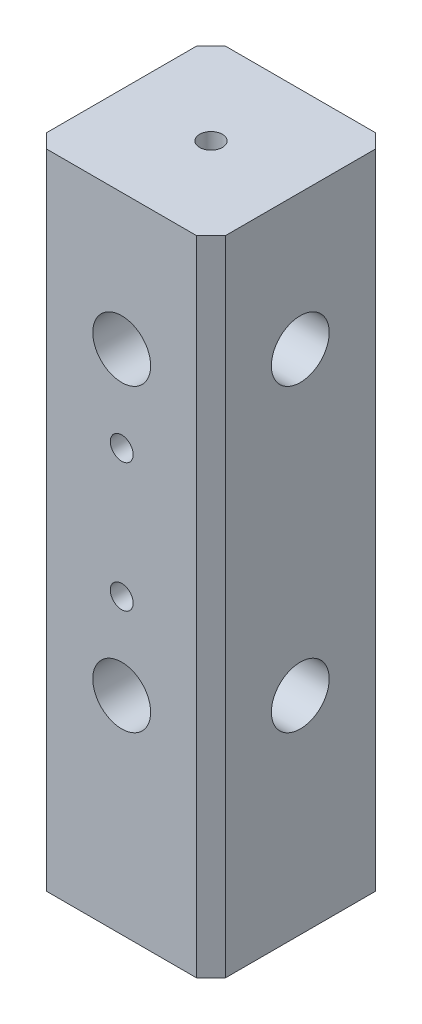
ISO-10303-21;
HEADER;
FILE_DESCRIPTION(('STEP AP214'),'2;1');
FILE_NAME('part.step','',(''),(''),'','','');
FILE_SCHEMA(('AUTOMOTIVE_DESIGN { 1 0 10303 214 1 1 1 1 }'));
ENDSEC;
DATA;
#1=APPLICATION_CONTEXT('core data for automotive mechanical design processes');
#2=APPLICATION_PROTOCOL_DEFINITION('international standard','automotive_design',2000,#1);
#3=PRODUCT_CONTEXT('',#1,'mechanical');
#4=PRODUCT('Part','Part','',(#3));
#5=PRODUCT_RELATED_PRODUCT_CATEGORY('part','',(#4));
#6=PRODUCT_DEFINITION_FORMATION('','',#4);
#7=PRODUCT_DEFINITION_CONTEXT('part definition',#1,'design');
#8=PRODUCT_DEFINITION('design','',#6,#7);
#9=PRODUCT_DEFINITION_SHAPE('','',#8);
#10=(LENGTH_UNIT() NAMED_UNIT(*) SI_UNIT(.MILLI.,.METRE.));
#11=(NAMED_UNIT(*) PLANE_ANGLE_UNIT() SI_UNIT($,.RADIAN.));
#12=(NAMED_UNIT(*) SI_UNIT($,.STERADIAN.) SOLID_ANGLE_UNIT());
#13=UNCERTAINTY_MEASURE_WITH_UNIT(LENGTH_MEASURE(1.E-05),#10,'distance_accuracy_value','');
#14=(GEOMETRIC_REPRESENTATION_CONTEXT(3) GLOBAL_UNCERTAINTY_ASSIGNED_CONTEXT((#13)) GLOBAL_UNIT_ASSIGNED_CONTEXT((#10,
#11,#12)) REPRESENTATION_CONTEXT('',''));
#15=CARTESIAN_POINT('',(0.,0.,0.));
#16=DIRECTION('',(0.,0.,1.));
#17=DIRECTION('',(1.,0.,0.));
#18=AXIS2_PLACEMENT_3D('',#15,#16,#17);
#19=CARTESIAN_POINT('',(12.5,90.,-12.5));
#20=DIRECTION('',(-1.,0.,0.));
#21=DIRECTION('',(0.,0.,1.));
#22=AXIS2_PLACEMENT_3D('',#19,#20,#21);
#23=PLANE('',#22);
#24=CARTESIAN_POINT('',(12.5,71.,0.));
#25=DIRECTION('',(1.,0.,0.));
#26=DIRECTION('',(0.,0.,-1.));
#27=AXIS2_PLACEMENT_3D('',#24,#25,#26);
#28=CIRCLE('',#27,4.05);
#29=CARTESIAN_POINT('',(12.5,71.,-4.05));
#30=VERTEX_POINT('',#29);
#31=EDGE_CURVE('E181',#30,#30,#28,.T.);
#32=ORIENTED_EDGE('',*,*,#31,.F.);
#33=EDGE_LOOP('',(#32));
#34=FACE_BOUND('',#33,.T.);
#35=CARTESIAN_POINT('',(12.5,29.,0.));
#36=DIRECTION('',(1.,0.,0.));
#37=DIRECTION('',(0.,0.,-1.));
#38=AXIS2_PLACEMENT_3D('',#35,#36,#37);
#39=CIRCLE('',#38,4.05);
#40=CARTESIAN_POINT('',(12.5,29.,-4.05));
#41=VERTEX_POINT('',#40);
#42=EDGE_CURVE('E133',#41,#41,#39,.T.);
#43=ORIENTED_EDGE('',*,*,#42,.F.);
#44=EDGE_LOOP('',(#43));
#45=FACE_BOUND('',#44,.T.);
#46=DIRECTION('',(0.,0.,-1.));
#47=VECTOR('',#46,1.);
#48=CARTESIAN_POINT('',(12.5,90.,-12.5));
#49=LINE('',#48,#47);
#50=CARTESIAN_POINT('',(12.5,90.,10.5));
#51=VERTEX_POINT('',#50);
#52=CARTESIAN_POINT('',(12.5,90.,-10.5));
#53=VERTEX_POINT('',#52);
#54=EDGE_CURVE('E120',#51,#53,#49,.T.);
#55=ORIENTED_EDGE('',*,*,#54,.F.);
#56=DIRECTION('',(0.,-1.,0.));
#57=VECTOR('',#56,1.);
#58=CARTESIAN_POINT('',(12.5,90.,10.5));
#59=LINE('',#58,#57);
#60=CARTESIAN_POINT('',(12.5,0.,10.5));
#61=VERTEX_POINT('',#60);
#62=EDGE_CURVE('E105',#51,#61,#59,.T.);
#63=ORIENTED_EDGE('',*,*,#62,.T.);
#64=DIRECTION('',(0.,0.,-1.));
#65=VECTOR('',#64,1.);
#66=CARTESIAN_POINT('',(12.5,0.,-12.5));
#67=LINE('',#66,#65);
#68=CARTESIAN_POINT('',(12.5,0.,-10.5));
#69=VERTEX_POINT('',#68);
#70=EDGE_CURVE('E117',#61,#69,#67,.T.);
#71=ORIENTED_EDGE('',*,*,#70,.T.);
#72=DIRECTION('',(0.,1.,0.));
#73=VECTOR('',#72,1.);
#74=CARTESIAN_POINT('',(12.5,90.,-10.5));
#75=LINE('',#74,#73);
#76=EDGE_CURVE('E122',#69,#53,#75,.T.);
#77=ORIENTED_EDGE('',*,*,#76,.T.);
#78=EDGE_LOOP('',(#55,#63,#71,#77));
#79=FACE_BOUND('',#78,.T.);
#80=ADVANCED_FACE('F35',(#34,#45,#79),#23,.F.);
#81=CARTESIAN_POINT('',(12.5,90.,-12.5));
#82=DIRECTION('',(0.,0.,1.));
#83=DIRECTION('',(1.,0.,0.));
#84=AXIS2_PLACEMENT_3D('',#81,#82,#83);
#85=PLANE('',#84);
#86=DIRECTION('',(-1.,0.,0.));
#87=VECTOR('',#86,1.);
#88=CARTESIAN_POINT('',(12.5,90.,-12.5));
#89=LINE('',#88,#87);
#90=CARTESIAN_POINT('',(10.5,90.,-12.5));
#91=VERTEX_POINT('',#90);
#92=CARTESIAN_POINT('',(-10.5,90.,-12.5));
#93=VERTEX_POINT('',#92);
#94=EDGE_CURVE('E166',#91,#93,#89,.T.);
#95=ORIENTED_EDGE('',*,*,#94,.F.);
#96=DIRECTION('',(0.,-1.,0.));
#97=VECTOR('',#96,1.);
#98=CARTESIAN_POINT('',(10.5,90.,-12.5));
#99=LINE('',#98,#97);
#100=CARTESIAN_POINT('',(10.5,0.,-12.5));
#101=VERTEX_POINT('',#100);
#102=EDGE_CURVE('E159',#91,#101,#99,.T.);
#103=ORIENTED_EDGE('',*,*,#102,.T.);
#104=DIRECTION('',(-1.,0.,0.));
#105=VECTOR('',#104,1.);
#106=CARTESIAN_POINT('',(12.5,0.,-12.5));
#107=LINE('',#106,#105);
#108=CARTESIAN_POINT('',(-10.5,0.,-12.5));
#109=VERTEX_POINT('',#108);
#110=EDGE_CURVE('E126',#101,#109,#107,.T.);
#111=ORIENTED_EDGE('',*,*,#110,.T.);
#112=DIRECTION('',(0.,1.,0.));
#113=VECTOR('',#112,1.);
#114=CARTESIAN_POINT('',(-10.5,90.,-12.5));
#115=LINE('',#114,#113);
#116=EDGE_CURVE('E157',#109,#93,#115,.T.);
#117=ORIENTED_EDGE('',*,*,#116,.T.);
#118=EDGE_LOOP('',(#95,#103,#111,#117));
#119=FACE_BOUND('',#118,.T.);
#120=ADVANCED_FACE('F164',(#119),#85,.F.);
#121=CARTESIAN_POINT('',(-12.5,90.,-12.5));
#122=DIRECTION('',(1.,0.,0.));
#123=DIRECTION('',(0.,0.,-1.));
#124=AXIS2_PLACEMENT_3D('',#121,#122,#123);
#125=PLANE('',#124);
#126=DIRECTION('',(0.,0.,1.));
#127=VECTOR('',#126,1.);
#128=CARTESIAN_POINT('',(-12.5,90.,-12.5));
#129=LINE('',#128,#127);
#130=CARTESIAN_POINT('',(-12.5,90.,-10.5));
#131=VERTEX_POINT('',#130);
#132=CARTESIAN_POINT('',(-12.5,90.,10.5));
#133=VERTEX_POINT('',#132);
#134=EDGE_CURVE('E174',#131,#133,#129,.T.);
#135=ORIENTED_EDGE('',*,*,#134,.F.);
#136=DIRECTION('',(0.,-1.,0.));
#137=VECTOR('',#136,1.);
#138=CARTESIAN_POINT('',(-12.5,90.,-10.5));
#139=LINE('',#138,#137);
#140=CARTESIAN_POINT('',(-12.5,0.,-10.5));
#141=VERTEX_POINT('',#140);
#142=EDGE_CURVE('E11',#131,#141,#139,.T.);
#143=ORIENTED_EDGE('',*,*,#142,.T.);
#144=DIRECTION('',(0.,0.,1.));
#145=VECTOR('',#144,1.);
#146=CARTESIAN_POINT('',(-12.5,0.,-12.5));
#147=LINE('',#146,#145);
#148=CARTESIAN_POINT('',(-12.5,0.,10.5));
#149=VERTEX_POINT('',#148);
#150=EDGE_CURVE('E130',#141,#149,#147,.T.);
#151=ORIENTED_EDGE('',*,*,#150,.T.);
#152=DIRECTION('',(0.,1.,0.));
#153=VECTOR('',#152,1.);
#154=CARTESIAN_POINT('',(-12.5,90.,10.5));
#155=LINE('',#154,#153);
#156=EDGE_CURVE('E43',#149,#133,#155,.T.);
#157=ORIENTED_EDGE('',*,*,#156,.T.);
#158=EDGE_LOOP('',(#135,#143,#151,#157));
#159=FACE_BOUND('',#158,.T.);
#160=ADVANCED_FACE('F173',(#159),#125,.F.);
#161=CARTESIAN_POINT('',(12.5,90.,12.5));
#162=DIRECTION('',(0.,0.,-1.));
#163=DIRECTION('',(-1.,0.,0.));
#164=AXIS2_PLACEMENT_3D('',#161,#162,#163);
#165=PLANE('',#164);
#166=CARTESIAN_POINT('',(0.,41.,12.5));
#167=DIRECTION('',(0.,0.,1.));
#168=DIRECTION('',(1.,0.,0.));
#169=AXIS2_PLACEMENT_3D('',#166,#167,#168);
#170=CIRCLE('',#169,1.6);
#171=CARTESIAN_POINT('',(1.6,41.,12.5));
#172=VERTEX_POINT('',#171);
#173=EDGE_CURVE('E207',#172,#172,#170,.T.);
#174=ORIENTED_EDGE('',*,*,#173,.F.);
#175=EDGE_LOOP('',(#174));
#176=FACE_BOUND('',#175,.T.);
#177=CARTESIAN_POINT('',(0.,59.,12.5));
#178=DIRECTION('',(0.,0.,1.));
#179=DIRECTION('',(1.,0.,0.));
#180=AXIS2_PLACEMENT_3D('',#177,#178,#179);
#181=CIRCLE('',#180,1.6);
#182=CARTESIAN_POINT('',(1.6,59.,12.5));
#183=VERTEX_POINT('',#182);
#184=EDGE_CURVE('E201',#183,#183,#181,.T.);
#185=ORIENTED_EDGE('',*,*,#184,.F.);
#186=EDGE_LOOP('',(#185));
#187=FACE_BOUND('',#186,.T.);
#188=CARTESIAN_POINT('',(0.,71.,12.5));
#189=DIRECTION('',(0.,0.,1.));
#190=DIRECTION('',(1.,0.,0.));
#191=AXIS2_PLACEMENT_3D('',#188,#189,#190);
#192=CIRCLE('',#191,4.05);
#193=CARTESIAN_POINT('',(4.05,71.,12.5));
#194=VERTEX_POINT('',#193);
#195=EDGE_CURVE('E192',#194,#194,#192,.T.);
#196=ORIENTED_EDGE('',*,*,#195,.F.);
#197=EDGE_LOOP('',(#196));
#198=FACE_BOUND('',#197,.T.);
#199=CARTESIAN_POINT('',(0.,29.,12.5));
#200=DIRECTION('',(0.,0.,1.));
#201=DIRECTION('',(1.,0.,0.));
#202=AXIS2_PLACEMENT_3D('',#199,#200,#201);
#203=CIRCLE('',#202,4.05);
#204=CARTESIAN_POINT('',(4.05,29.,12.5));
#205=VERTEX_POINT('',#204);
#206=EDGE_CURVE('E189',#205,#205,#203,.T.);
#207=ORIENTED_EDGE('',*,*,#206,.F.);
#208=EDGE_LOOP('',(#207));
#209=FACE_BOUND('',#208,.T.);
#210=DIRECTION('',(1.,0.,0.));
#211=VECTOR('',#210,1.);
#212=CARTESIAN_POINT('',(12.5,0.,12.5));
#213=LINE('',#212,#211);
#214=CARTESIAN_POINT('',(-10.5,0.,12.5));
#215=VERTEX_POINT('',#214);
#216=CARTESIAN_POINT('',(10.5,0.,12.5));
#217=VERTEX_POINT('',#216);
#218=EDGE_CURVE('E140',#215,#217,#213,.T.);
#219=ORIENTED_EDGE('',*,*,#218,.T.);
#220=DIRECTION('',(0.,1.,0.));
#221=VECTOR('',#220,1.);
#222=CARTESIAN_POINT('',(10.5,90.,12.5));
#223=LINE('',#222,#221);
#224=CARTESIAN_POINT('',(10.5,90.,12.5));
#225=VERTEX_POINT('',#224);
#226=EDGE_CURVE('E106',#217,#225,#223,.T.);
#227=ORIENTED_EDGE('',*,*,#226,.T.);
#228=DIRECTION('',(1.,0.,0.));
#229=VECTOR('',#228,1.);
#230=CARTESIAN_POINT('',(12.5,90.,12.5));
#231=LINE('',#230,#229);
#232=CARTESIAN_POINT('',(-10.5,90.,12.5));
#233=VERTEX_POINT('',#232);
#234=EDGE_CURVE('E136',#233,#225,#231,.T.);
#235=ORIENTED_EDGE('',*,*,#234,.F.);
#236=DIRECTION('',(0.,-1.,0.));
#237=VECTOR('',#236,1.);
#238=CARTESIAN_POINT('',(-10.5,90.,12.5));
#239=LINE('',#238,#237);
#240=EDGE_CURVE('E111',#233,#215,#239,.T.);
#241=ORIENTED_EDGE('',*,*,#240,.T.);
#242=EDGE_LOOP('',(#219,#227,#235,#241));
#243=FACE_BOUND('',#242,.T.);
#244=ADVANCED_FACE('F230',(#176,#187,#198,#209,#243),#165,.F.);
#245=CARTESIAN_POINT('',(12.5,90.,12.5));
#246=DIRECTION('',(0.,-1.,0.));
#247=DIRECTION('',(0.,0.,-1.));
#248=AXIS2_PLACEMENT_3D('',#245,#246,#247);
#249=PLANE('',#248);
#250=CARTESIAN_POINT('',(0.,90.,0.));
#251=DIRECTION('',(0.,1.,0.));
#252=DIRECTION('',(0.,0.,1.));
#253=AXIS2_PLACEMENT_3D('',#250,#251,#252);
#254=CIRCLE('',#253,1.6);
#255=CARTESIAN_POINT('',(0.,90.,1.6));
#256=VERTEX_POINT('',#255);
#257=EDGE_CURVE('E213',#256,#256,#254,.T.);
#258=ORIENTED_EDGE('',*,*,#257,.F.);
#259=EDGE_LOOP('',(#258));
#260=FACE_BOUND('',#259,.T.);
#261=ORIENTED_EDGE('',*,*,#234,.T.);
#262=DIRECTION('',(-0.70710678118655,0.,0.707106781186545));
#263=VECTOR('',#262,1.);
#264=CARTESIAN_POINT('',(12.5,90.,10.5));
#265=LINE('',#264,#263);
#266=EDGE_CURVE('E155',#225,#51,#265,.F.);
#267=ORIENTED_EDGE('',*,*,#266,.T.);
#268=ORIENTED_EDGE('',*,*,#54,.T.);
#269=DIRECTION('',(0.707106781186545,0.,0.70710678118655));
#270=VECTOR('',#269,1.);
#271=CARTESIAN_POINT('',(10.5,90.,-12.5));
#272=LINE('',#271,#270);
#273=EDGE_CURVE('E153',#53,#91,#272,.F.);
#274=ORIENTED_EDGE('',*,*,#273,.T.);
#275=ORIENTED_EDGE('',*,*,#94,.T.);
#276=DIRECTION('',(0.707106781186551,0.,-0.707106781186544));
#277=VECTOR('',#276,1.);
#278=CARTESIAN_POINT('',(-12.5,90.,-10.5));
#279=LINE('',#278,#277);
#280=EDGE_CURVE('E56',#93,#131,#279,.F.);
#281=ORIENTED_EDGE('',*,*,#280,.T.);
#282=ORIENTED_EDGE('',*,*,#134,.T.);
#283=DIRECTION('',(-0.707106781186545,0.,-0.70710678118655));
#284=VECTOR('',#283,1.);
#285=CARTESIAN_POINT('',(-10.5,90.,12.5));
#286=LINE('',#285,#284);
#287=EDGE_CURVE('E150',#133,#233,#286,.F.);
#288=ORIENTED_EDGE('',*,*,#287,.T.);
#289=EDGE_LOOP('',(#261,#267,#268,#274,#275,#281,#282,#288));
#290=FACE_BOUND('',#289,.T.);
#291=ADVANCED_FACE('F228',(#260,#290),#249,.F.);
#292=CARTESIAN_POINT('',(12.5,0.,12.5));
#293=DIRECTION('',(0.,-1.,0.));
#294=DIRECTION('',(0.,0.,-1.));
#295=AXIS2_PLACEMENT_3D('',#292,#293,#294);
#296=PLANE('',#295);
#297=ORIENTED_EDGE('',*,*,#70,.F.);
#298=DIRECTION('',(0.70710678118655,0.,-0.707106781186545));
#299=VECTOR('',#298,1.);
#300=CARTESIAN_POINT('',(11.5,0.,11.5));
#301=LINE('',#300,#299);
#302=EDGE_CURVE('E101',#61,#217,#301,.F.);
#303=ORIENTED_EDGE('',*,*,#302,.T.);
#304=ORIENTED_EDGE('',*,*,#218,.F.);
#305=DIRECTION('',(0.707106781186545,0.,0.70710678118655));
#306=VECTOR('',#305,1.);
#307=CARTESIAN_POINT('',(0.999999999999912,0.,24.));
#308=LINE('',#307,#306);
#309=EDGE_CURVE('E121',#215,#149,#308,.F.);
#310=ORIENTED_EDGE('',*,*,#309,.T.);
#311=ORIENTED_EDGE('',*,*,#150,.F.);
#312=DIRECTION('',(-0.707106781186551,0.,0.707106781186544));
#313=VECTOR('',#312,1.);
#314=CARTESIAN_POINT('',(-11.4999999999999,0.,-11.5000000000001));
#315=LINE('',#314,#313);
#316=EDGE_CURVE('E144',#141,#109,#315,.F.);
#317=ORIENTED_EDGE('',*,*,#316,.T.);
#318=ORIENTED_EDGE('',*,*,#110,.F.);
#319=DIRECTION('',(-0.707106781186545,0.,-0.70710678118655));
#320=VECTOR('',#319,1.);
#321=CARTESIAN_POINT('',(24.,0.,1.00000000000007));
#322=LINE('',#321,#320);
#323=EDGE_CURVE('E112',#101,#69,#322,.F.);
#324=ORIENTED_EDGE('',*,*,#323,.T.);
#325=EDGE_LOOP('',(#297,#303,#304,#310,#311,#317,#318,#324));
#326=FACE_BOUND('',#325,.T.);
#327=ADVANCED_FACE('F124',(#326),#296,.T.);
#328=CARTESIAN_POINT('',(4.5,29.,0.));
#329=DIRECTION('',(1.,0.,0.));
#330=DIRECTION('',(0.,0.,-1.));
#331=AXIS2_PLACEMENT_3D('',#328,#329,#330);
#332=CYLINDRICAL_SURFACE('',#331,4.05);
#333=CARTESIAN_POINT('',(4.5,29.,0.));
#334=DIRECTION('',(1.,0.,0.));
#335=DIRECTION('',(0.,0.,-1.));
#336=AXIS2_PLACEMENT_3D('',#333,#334,#335);
#337=CIRCLE('',#336,4.05);
#338=CARTESIAN_POINT('',(4.5,29.,-4.05));
#339=VERTEX_POINT('',#338);
#340=EDGE_CURVE('E127',#339,#339,#337,.T.);
#341=ORIENTED_EDGE('',*,*,#340,.F.);
#342=EDGE_LOOP('',(#341));
#343=FACE_BOUND('',#342,.T.);
#344=ORIENTED_EDGE('',*,*,#42,.T.);
#345=EDGE_LOOP('',(#344));
#346=FACE_BOUND('',#345,.T.);
#347=ADVANCED_FACE('F372',(#343,#346),#332,.F.);
#348=CARTESIAN_POINT('',(4.5,29.,0.));
#349=DIRECTION('',(1.,0.,0.));
#350=DIRECTION('',(0.,0.,-1.));
#351=AXIS2_PLACEMENT_3D('',#348,#349,#350);
#352=PLANE('',#351);
#353=ORIENTED_EDGE('',*,*,#340,.T.);
#354=EDGE_LOOP('',(#353));
#355=FACE_BOUND('',#354,.T.);
#356=ADVANCED_FACE('F365',(#355),#352,.T.);
#357=CARTESIAN_POINT('',(4.5,71.,0.));
#358=DIRECTION('',(1.,0.,0.));
#359=DIRECTION('',(0.,0.,-1.));
#360=AXIS2_PLACEMENT_3D('',#357,#358,#359);
#361=CYLINDRICAL_SURFACE('',#360,4.05);
#362=CARTESIAN_POINT('',(4.5,71.,0.));
#363=DIRECTION('',(1.,0.,0.));
#364=DIRECTION('',(0.,0.,-1.));
#365=AXIS2_PLACEMENT_3D('',#362,#363,#364);
#366=CIRCLE('',#365,4.05);
#367=CARTESIAN_POINT('',(4.5,71.,-4.04999999999999));
#368=VERTEX_POINT('',#367);
#369=EDGE_CURVE('E183',#368,#368,#366,.T.);
#370=ORIENTED_EDGE('',*,*,#369,.F.);
#371=EDGE_LOOP('',(#370));
#372=FACE_BOUND('',#371,.T.);
#373=ORIENTED_EDGE('',*,*,#31,.T.);
#374=EDGE_LOOP('',(#373));
#375=FACE_BOUND('',#374,.T.);
#376=ADVANCED_FACE('F362',(#372,#375),#361,.F.);
#377=CARTESIAN_POINT('',(4.5,71.,0.));
#378=DIRECTION('',(1.,0.,0.));
#379=DIRECTION('',(0.,0.,-1.));
#380=AXIS2_PLACEMENT_3D('',#377,#378,#379);
#381=PLANE('',#380);
#382=ORIENTED_EDGE('',*,*,#369,.T.);
#383=EDGE_LOOP('',(#382));
#384=FACE_BOUND('',#383,.T.);
#385=ADVANCED_FACE('F360',(#384),#381,.T.);
#386=CARTESIAN_POINT('',(0.,29.,4.5));
#387=DIRECTION('',(0.,0.,1.));
#388=DIRECTION('',(1.,0.,0.));
#389=AXIS2_PLACEMENT_3D('',#386,#387,#388);
#390=CYLINDRICAL_SURFACE('',#389,4.05);
#391=CARTESIAN_POINT('',(0.,29.,4.5));
#392=DIRECTION('',(0.,0.,1.));
#393=DIRECTION('',(1.,0.,0.));
#394=AXIS2_PLACEMENT_3D('',#391,#392,#393);
#395=CIRCLE('',#394,4.05);
#396=CARTESIAN_POINT('',(4.05,29.,4.5));
#397=VERTEX_POINT('',#396);
#398=EDGE_CURVE('E186',#397,#397,#395,.T.);
#399=ORIENTED_EDGE('',*,*,#398,.F.);
#400=EDGE_LOOP('',(#399));
#401=FACE_BOUND('',#400,.T.);
#402=ORIENTED_EDGE('',*,*,#206,.T.);
#403=EDGE_LOOP('',(#402));
#404=FACE_BOUND('',#403,.T.);
#405=ADVANCED_FACE('F356',(#401,#404),#390,.F.);
#406=CARTESIAN_POINT('',(0.,29.,4.5));
#407=DIRECTION('',(0.,0.,1.));
#408=DIRECTION('',(1.,0.,0.));
#409=AXIS2_PLACEMENT_3D('',#406,#407,#408);
#410=PLANE('',#409);
#411=ORIENTED_EDGE('',*,*,#398,.T.);
#412=EDGE_LOOP('',(#411));
#413=FACE_BOUND('',#412,.T.);
#414=ADVANCED_FACE('F350',(#413),#410,.T.);
#415=CARTESIAN_POINT('',(0.,71.,4.5));
#416=DIRECTION('',(0.,0.,1.));
#417=DIRECTION('',(1.,0.,0.));
#418=AXIS2_PLACEMENT_3D('',#415,#416,#417);
#419=CYLINDRICAL_SURFACE('',#418,4.05);
#420=CARTESIAN_POINT('',(0.,71.,4.5));
#421=DIRECTION('',(0.,0.,1.));
#422=DIRECTION('',(1.,0.,0.));
#423=AXIS2_PLACEMENT_3D('',#420,#421,#422);
#424=CIRCLE('',#423,4.05);
#425=CARTESIAN_POINT('',(4.05,71.,4.5));
#426=VERTEX_POINT('',#425);
#427=EDGE_CURVE('E195',#426,#426,#424,.T.);
#428=ORIENTED_EDGE('',*,*,#427,.F.);
#429=EDGE_LOOP('',(#428));
#430=FACE_BOUND('',#429,.T.);
#431=ORIENTED_EDGE('',*,*,#195,.T.);
#432=EDGE_LOOP('',(#431));
#433=FACE_BOUND('',#432,.T.);
#434=ADVANCED_FACE('F347',(#430,#433),#419,.F.);
#435=CARTESIAN_POINT('',(0.,71.,4.5));
#436=DIRECTION('',(0.,0.,1.));
#437=DIRECTION('',(1.,0.,0.));
#438=AXIS2_PLACEMENT_3D('',#435,#436,#437);
#439=PLANE('',#438);
#440=ORIENTED_EDGE('',*,*,#427,.T.);
#441=EDGE_LOOP('',(#440));
#442=FACE_BOUND('',#441,.T.);
#443=ADVANCED_FACE('F259',(#442),#439,.T.);
#444=CARTESIAN_POINT('',(12.5,90.,10.5));
#445=DIRECTION('',(-0.707106781186545,0.,-0.70710678118655));
#446=DIRECTION('',(-0.70710678118655,0.,0.707106781186545));
#447=AXIS2_PLACEMENT_3D('',#444,#445,#446);
#448=PLANE('',#447);
#449=ORIENTED_EDGE('',*,*,#266,.F.);
#450=ORIENTED_EDGE('',*,*,#226,.F.);
#451=ORIENTED_EDGE('',*,*,#302,.F.);
#452=ORIENTED_EDGE('',*,*,#62,.F.);
#453=EDGE_LOOP('',(#449,#450,#451,#452));
#454=FACE_BOUND('',#453,.T.);
#455=ADVANCED_FACE('F104',(#454),#448,.F.);
#456=CARTESIAN_POINT('',(10.5,90.,-12.5));
#457=DIRECTION('',(-0.70710678118655,0.,0.707106781186545));
#458=DIRECTION('',(0.707106781186545,0.,0.70710678118655));
#459=AXIS2_PLACEMENT_3D('',#456,#457,#458);
#460=PLANE('',#459);
#461=ORIENTED_EDGE('',*,*,#273,.F.);
#462=ORIENTED_EDGE('',*,*,#76,.F.);
#463=ORIENTED_EDGE('',*,*,#323,.F.);
#464=ORIENTED_EDGE('',*,*,#102,.F.);
#465=EDGE_LOOP('',(#461,#462,#463,#464));
#466=FACE_BOUND('',#465,.T.);
#467=ADVANCED_FACE('F245',(#466),#460,.F.);
#468=CARTESIAN_POINT('',(-12.5,90.,-10.5));
#469=DIRECTION('',(0.707106781186544,0.,0.707106781186551));
#470=DIRECTION('',(0.707106781186551,0.,-0.707106781186544));
#471=AXIS2_PLACEMENT_3D('',#468,#469,#470);
#472=PLANE('',#471);
#473=ORIENTED_EDGE('',*,*,#280,.F.);
#474=ORIENTED_EDGE('',*,*,#116,.F.);
#475=ORIENTED_EDGE('',*,*,#316,.F.);
#476=ORIENTED_EDGE('',*,*,#142,.F.);
#477=EDGE_LOOP('',(#473,#474,#475,#476));
#478=FACE_BOUND('',#477,.T.);
#479=ADVANCED_FACE('F172',(#478),#472,.F.);
#480=CARTESIAN_POINT('',(-10.5,90.,12.5));
#481=DIRECTION('',(0.70710678118655,0.,-0.707106781186545));
#482=DIRECTION('',(-0.707106781186545,0.,-0.70710678118655));
#483=AXIS2_PLACEMENT_3D('',#480,#481,#482);
#484=PLANE('',#483);
#485=ORIENTED_EDGE('',*,*,#287,.F.);
#486=ORIENTED_EDGE('',*,*,#156,.F.);
#487=ORIENTED_EDGE('',*,*,#309,.F.);
#488=ORIENTED_EDGE('',*,*,#240,.F.);
#489=EDGE_LOOP('',(#485,#486,#487,#488));
#490=FACE_BOUND('',#489,.T.);
#491=ADVANCED_FACE('F37',(#490),#484,.F.);
#492=CARTESIAN_POINT('',(0.,59.,0.));
#493=DIRECTION('',(0.,0.,1.));
#494=DIRECTION('',(1.,0.,0.));
#495=AXIS2_PLACEMENT_3D('',#492,#493,#494);
#496=CYLINDRICAL_SURFACE('',#495,1.6);
#497=CARTESIAN_POINT('',(0.,59.,0.));
#498=DIRECTION('',(0.,0.,1.));
#499=DIRECTION('',(1.,0.,0.));
#500=AXIS2_PLACEMENT_3D('',#497,#498,#499);
#501=CIRCLE('',#500,1.6);
#502=CARTESIAN_POINT('',(1.6,59.,0.));
#503=VERTEX_POINT('',#502);
#504=EDGE_CURVE('E198',#503,#503,#501,.T.);
#505=ORIENTED_EDGE('',*,*,#504,.F.);
#506=EDGE_LOOP('',(#505));
#507=FACE_BOUND('',#506,.T.);
#508=ORIENTED_EDGE('',*,*,#184,.T.);
#509=EDGE_LOOP('',(#508));
#510=FACE_BOUND('',#509,.T.);
#511=ADVANCED_FACE('F237',(#507,#510),#496,.F.);
#512=CARTESIAN_POINT('',(0.,59.,0.));
#513=DIRECTION('',(0.,0.,1.));
#514=DIRECTION('',(1.,0.,0.));
#515=AXIS2_PLACEMENT_3D('',#512,#513,#514);
#516=PLANE('',#515);
#517=ORIENTED_EDGE('',*,*,#504,.T.);
#518=EDGE_LOOP('',(#517));
#519=FACE_BOUND('',#518,.T.);
#520=ADVANCED_FACE('F242',(#519),#516,.T.);
#521=CARTESIAN_POINT('',(0.,41.,0.));
#522=DIRECTION('',(0.,0.,1.));
#523=DIRECTION('',(1.,0.,0.));
#524=AXIS2_PLACEMENT_3D('',#521,#522,#523);
#525=CYLINDRICAL_SURFACE('',#524,1.6);
#526=CARTESIAN_POINT('',(0.,41.,0.));
#527=DIRECTION('',(0.,0.,1.));
#528=DIRECTION('',(1.,0.,0.));
#529=AXIS2_PLACEMENT_3D('',#526,#527,#528);
#530=CIRCLE('',#529,1.6);
#531=CARTESIAN_POINT('',(1.6,41.,0.));
#532=VERTEX_POINT('',#531);
#533=EDGE_CURVE('E204',#532,#532,#530,.T.);
#534=ORIENTED_EDGE('',*,*,#533,.F.);
#535=EDGE_LOOP('',(#534));
#536=FACE_BOUND('',#535,.T.);
#537=ORIENTED_EDGE('',*,*,#173,.T.);
#538=EDGE_LOOP('',(#537));
#539=FACE_BOUND('',#538,.T.);
#540=ADVANCED_FACE('F302',(#536,#539),#525,.F.);
#541=CARTESIAN_POINT('',(0.,41.,0.));
#542=DIRECTION('',(0.,0.,1.));
#543=DIRECTION('',(1.,0.,0.));
#544=AXIS2_PLACEMENT_3D('',#541,#542,#543);
#545=PLANE('',#544);
#546=ORIENTED_EDGE('',*,*,#533,.T.);
#547=EDGE_LOOP('',(#546));
#548=FACE_BOUND('',#547,.T.);
#549=ADVANCED_FACE('F224',(#548),#545,.T.);
#550=CARTESIAN_POINT('',(0.,80.,0.));
#551=DIRECTION('',(0.,1.,0.));
#552=DIRECTION('',(0.,0.,1.));
#553=AXIS2_PLACEMENT_3D('',#550,#551,#552);
#554=CYLINDRICAL_SURFACE('',#553,1.6);
#555=CARTESIAN_POINT('',(0.,80.,0.));
#556=DIRECTION('',(0.,1.,0.));
#557=DIRECTION('',(0.,0.,1.));
#558=AXIS2_PLACEMENT_3D('',#555,#556,#557);
#559=CIRCLE('',#558,1.6);
#560=CARTESIAN_POINT('',(0.,80.,1.6));
#561=VERTEX_POINT('',#560);
#562=EDGE_CURVE('E210',#561,#561,#559,.T.);
#563=ORIENTED_EDGE('',*,*,#562,.F.);
#564=EDGE_LOOP('',(#563));
#565=FACE_BOUND('',#564,.T.);
#566=ORIENTED_EDGE('',*,*,#257,.T.);
#567=EDGE_LOOP('',(#566));
#568=FACE_BOUND('',#567,.T.);
#569=ADVANCED_FACE('F221',(#565,#568),#554,.F.);
#570=CARTESIAN_POINT('',(0.,80.,0.));
#571=DIRECTION('',(0.,1.,0.));
#572=DIRECTION('',(0.,0.,1.));
#573=AXIS2_PLACEMENT_3D('',#570,#571,#572);
#574=PLANE('',#573);
#575=ORIENTED_EDGE('',*,*,#562,.T.);
#576=EDGE_LOOP('',(#575));
#577=FACE_BOUND('',#576,.T.);
#578=ADVANCED_FACE('F219',(#577),#574,.T.);
#579=CLOSED_SHELL('',(#80,#120,#160,#244,#291,#327,#347,#356,#376,#385,#405,#414,#434,#443,#455,
#467,#479,#491,#511,#520,#540,#549,#569,#578));
#580=MANIFOLD_SOLID_BREP('B2',#579);
#581=ADVANCED_BREP_SHAPE_REPRESENTATION('',(#18,#580),#14);
#582=SHAPE_DEFINITION_REPRESENTATION(#9,#581);
ENDSEC;
END-ISO-10303-21;
